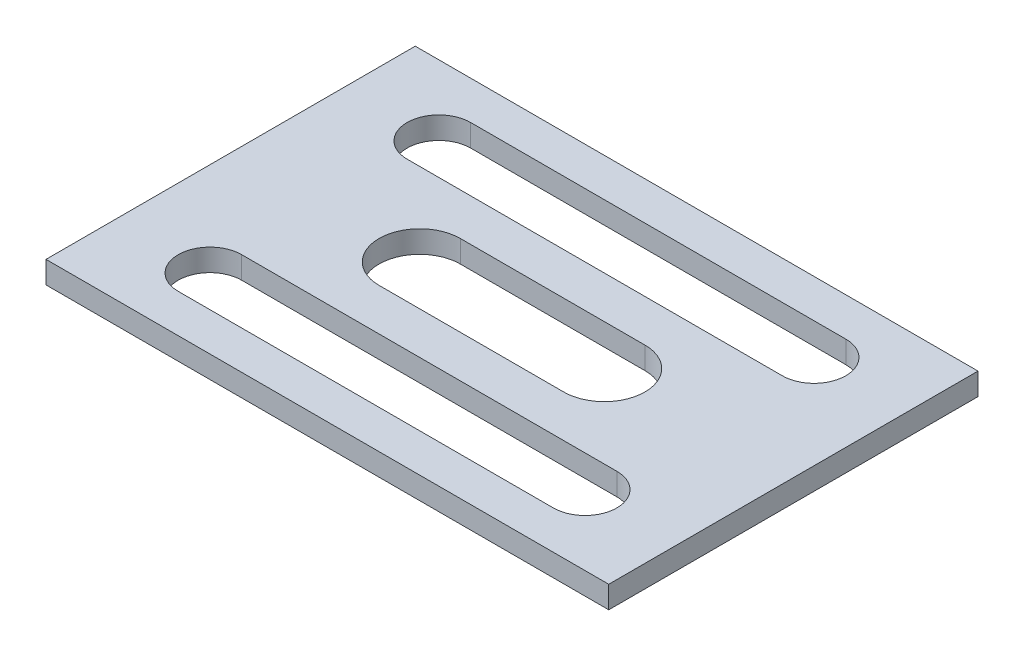
ISO-10303-21;
HEADER;
FILE_DESCRIPTION(('STEP AP214'),'2;1');
FILE_NAME('part.step','',(''),(''),'','','');
FILE_SCHEMA(('AUTOMOTIVE_DESIGN { 1 0 10303 214 1 1 1 1 }'));
ENDSEC;
DATA;
#1=APPLICATION_CONTEXT('core data for automotive mechanical design processes');
#2=APPLICATION_PROTOCOL_DEFINITION('international standard','automotive_design',2000,#1);
#3=PRODUCT_CONTEXT('',#1,'mechanical');
#4=PRODUCT('Part','Part','',(#3));
#5=PRODUCT_RELATED_PRODUCT_CATEGORY('part','',(#4));
#6=PRODUCT_DEFINITION_FORMATION('','',#4);
#7=PRODUCT_DEFINITION_CONTEXT('part definition',#1,'design');
#8=PRODUCT_DEFINITION('design','',#6,#7);
#9=PRODUCT_DEFINITION_SHAPE('','',#8);
#10=(LENGTH_UNIT() NAMED_UNIT(*) SI_UNIT(.MILLI.,.METRE.));
#11=(NAMED_UNIT(*) PLANE_ANGLE_UNIT() SI_UNIT($,.RADIAN.));
#12=(NAMED_UNIT(*) SI_UNIT($,.STERADIAN.) SOLID_ANGLE_UNIT());
#13=UNCERTAINTY_MEASURE_WITH_UNIT(LENGTH_MEASURE(1.E-05),#10,'distance_accuracy_value','');
#14=(GEOMETRIC_REPRESENTATION_CONTEXT(3) GLOBAL_UNCERTAINTY_ASSIGNED_CONTEXT((#13)) GLOBAL_UNIT_ASSIGNED_CONTEXT((#10,
#11,#12)) REPRESENTATION_CONTEXT('',''));
#15=CARTESIAN_POINT('',(0.,0.,0.));
#16=DIRECTION('',(0.,0.,1.));
#17=DIRECTION('',(1.,0.,0.));
#18=AXIS2_PLACEMENT_3D('',#15,#16,#17);
#19=CARTESIAN_POINT('',(38.1,3.,-25.));
#20=DIRECTION('',(-1.,0.,0.));
#21=DIRECTION('',(0.,0.,1.));
#22=AXIS2_PLACEMENT_3D('',#19,#20,#21);
#23=PLANE('',#22);
#24=DIRECTION('',(0.,0.,-1.));
#25=VECTOR('',#24,1.);
#26=CARTESIAN_POINT('',(38.1,0.,-25.));
#27=LINE('',#26,#25);
#28=CARTESIAN_POINT('',(38.1,0.,25.));
#29=VERTEX_POINT('',#28);
#30=CARTESIAN_POINT('',(38.1,0.,-25.));
#31=VERTEX_POINT('',#30);
#32=EDGE_CURVE('E238',#29,#31,#27,.T.);
#33=ORIENTED_EDGE('',*,*,#32,.T.);
#34=DIRECTION('',(0.,-1.,0.));
#35=VECTOR('',#34,1.);
#36=CARTESIAN_POINT('',(38.1,3.,-25.));
#37=LINE('',#36,#35);
#38=CARTESIAN_POINT('',(38.1,3.,-25.));
#39=VERTEX_POINT('',#38);
#40=EDGE_CURVE('E11',#39,#31,#37,.T.);
#41=ORIENTED_EDGE('',*,*,#40,.F.);
#42=DIRECTION('',(0.,0.,-1.));
#43=VECTOR('',#42,1.);
#44=CARTESIAN_POINT('',(38.1,3.,-25.));
#45=LINE('',#44,#43);
#46=CARTESIAN_POINT('',(38.1,3.,25.));
#47=VERTEX_POINT('',#46);
#48=EDGE_CURVE('E245',#47,#39,#45,.T.);
#49=ORIENTED_EDGE('',*,*,#48,.F.);
#50=DIRECTION('',(0.,-1.,0.));
#51=VECTOR('',#50,1.);
#52=CARTESIAN_POINT('',(38.1,3.,25.));
#53=LINE('',#52,#51);
#54=EDGE_CURVE('E255',#47,#29,#53,.T.);
#55=ORIENTED_EDGE('',*,*,#54,.T.);
#56=EDGE_LOOP('',(#33,#41,#49,#55));
#57=FACE_BOUND('',#56,.T.);
#58=ADVANCED_FACE('F32',(#57),#23,.F.);
#59=CARTESIAN_POINT('',(-38.1,3.,-25.));
#60=DIRECTION('',(0.,0.,1.));
#61=DIRECTION('',(1.,0.,0.));
#62=AXIS2_PLACEMENT_3D('',#59,#60,#61);
#63=PLANE('',#62);
#64=DIRECTION('',(-1.,0.,0.));
#65=VECTOR('',#64,1.);
#66=CARTESIAN_POINT('',(-38.1,0.,-25.));
#67=LINE('',#66,#65);
#68=CARTESIAN_POINT('',(-38.1,0.,-25.));
#69=VERTEX_POINT('',#68);
#70=EDGE_CURVE('E258',#31,#69,#67,.T.);
#71=ORIENTED_EDGE('',*,*,#70,.T.);
#72=DIRECTION('',(0.,-1.,0.));
#73=VECTOR('',#72,1.);
#74=CARTESIAN_POINT('',(-38.1,3.,-25.));
#75=LINE('',#74,#73);
#76=CARTESIAN_POINT('',(-38.1,3.,-25.));
#77=VERTEX_POINT('',#76);
#78=EDGE_CURVE('E39',#77,#69,#75,.T.);
#79=ORIENTED_EDGE('',*,*,#78,.F.);
#80=DIRECTION('',(-1.,0.,0.));
#81=VECTOR('',#80,1.);
#82=CARTESIAN_POINT('',(-38.1,3.,-25.));
#83=LINE('',#82,#81);
#84=EDGE_CURVE('E248',#39,#77,#83,.T.);
#85=ORIENTED_EDGE('',*,*,#84,.F.);
#86=ORIENTED_EDGE('',*,*,#40,.T.);
#87=EDGE_LOOP('',(#71,#79,#85,#86));
#88=FACE_BOUND('',#87,.T.);
#89=ADVANCED_FACE('F287',(#88),#63,.F.);
#90=CARTESIAN_POINT('',(-38.1,3.,-25.));
#91=DIRECTION('',(1.,0.,0.));
#92=DIRECTION('',(0.,0.,-1.));
#93=AXIS2_PLACEMENT_3D('',#90,#91,#92);
#94=PLANE('',#93);
#95=DIRECTION('',(0.,0.,1.));
#96=VECTOR('',#95,1.);
#97=CARTESIAN_POINT('',(-38.1,0.,-25.));
#98=LINE('',#97,#96);
#99=CARTESIAN_POINT('',(-38.1,0.,25.));
#100=VERTEX_POINT('',#99);
#101=EDGE_CURVE('E260',#69,#100,#98,.T.);
#102=ORIENTED_EDGE('',*,*,#101,.T.);
#103=DIRECTION('',(0.,-1.,0.));
#104=VECTOR('',#103,1.);
#105=CARTESIAN_POINT('',(-38.1,3.,25.));
#106=LINE('',#105,#104);
#107=CARTESIAN_POINT('',(-38.1,3.,25.));
#108=VERTEX_POINT('',#107);
#109=EDGE_CURVE('E265',#108,#100,#106,.T.);
#110=ORIENTED_EDGE('',*,*,#109,.F.);
#111=DIRECTION('',(0.,0.,1.));
#112=VECTOR('',#111,1.);
#113=CARTESIAN_POINT('',(-38.1,3.,-25.));
#114=LINE('',#113,#112);
#115=EDGE_CURVE('E251',#77,#108,#114,.T.);
#116=ORIENTED_EDGE('',*,*,#115,.F.);
#117=ORIENTED_EDGE('',*,*,#78,.T.);
#118=EDGE_LOOP('',(#102,#110,#116,#117));
#119=FACE_BOUND('',#118,.T.);
#120=ADVANCED_FACE('F272',(#119),#94,.F.);
#121=CARTESIAN_POINT('',(-38.1,3.,25.));
#122=DIRECTION('',(0.,0.,-1.));
#123=DIRECTION('',(-1.,0.,0.));
#124=AXIS2_PLACEMENT_3D('',#121,#122,#123);
#125=PLANE('',#124);
#126=DIRECTION('',(1.,0.,0.));
#127=VECTOR('',#126,1.);
#128=CARTESIAN_POINT('',(-38.1,0.,25.));
#129=LINE('',#128,#127);
#130=EDGE_CURVE('E249',#100,#29,#129,.T.);
#131=ORIENTED_EDGE('',*,*,#130,.T.);
#132=ORIENTED_EDGE('',*,*,#54,.F.);
#133=DIRECTION('',(1.,0.,0.));
#134=VECTOR('',#133,1.);
#135=CARTESIAN_POINT('',(-38.1,3.,25.));
#136=LINE('',#135,#134);
#137=EDGE_CURVE('E253',#108,#47,#136,.T.);
#138=ORIENTED_EDGE('',*,*,#137,.F.);
#139=ORIENTED_EDGE('',*,*,#109,.T.);
#140=EDGE_LOOP('',(#131,#132,#138,#139));
#141=FACE_BOUND('',#140,.T.);
#142=ADVANCED_FACE('F280',(#141),#125,.F.);
#143=CARTESIAN_POINT('',(0.,3.,0.));
#144=DIRECTION('',(0.,1.,0.));
#145=DIRECTION('',(0.,0.,1.));
#146=AXIS2_PLACEMENT_3D('',#143,#144,#145);
#147=PLANE('',#146);
#148=CARTESIAN_POINT('',(-12.5,3.,0.));
#149=DIRECTION('',(0.,1.,0.));
#150=DIRECTION('',(0.,0.,1.));
#151=AXIS2_PLACEMENT_3D('',#148,#149,#150);
#152=CIRCLE('',#151,5.50000000000006);
#153=CARTESIAN_POINT('',(-12.5,3.,-5.5));
#154=VERTEX_POINT('',#153);
#155=CARTESIAN_POINT('',(-12.5,3.,5.50000000000012));
#156=VERTEX_POINT('',#155);
#157=EDGE_CURVE('E46',#154,#156,#152,.T.);
#158=ORIENTED_EDGE('',*,*,#157,.F.);
#159=DIRECTION('',(-1.,0.,0.));
#160=VECTOR('',#159,1.);
#161=CARTESIAN_POINT('',(-12.5,3.,-5.5));
#162=LINE('',#161,#160);
#163=CARTESIAN_POINT('',(12.5,3.,-5.50000000000001));
#164=VERTEX_POINT('',#163);
#165=EDGE_CURVE('E162',#164,#154,#162,.T.);
#166=ORIENTED_EDGE('',*,*,#165,.F.);
#167=CARTESIAN_POINT('',(12.5,3.,0.));
#168=DIRECTION('',(0.,1.,0.));
#169=DIRECTION('',(0.,0.,1.));
#170=AXIS2_PLACEMENT_3D('',#167,#168,#169);
#171=CIRCLE('',#170,5.50000000000006);
#172=CARTESIAN_POINT('',(12.5,3.,5.50000000000006));
#173=VERTEX_POINT('',#172);
#174=EDGE_CURVE('E165',#173,#164,#171,.T.);
#175=ORIENTED_EDGE('',*,*,#174,.F.);
#176=DIRECTION('',(1.,0.,0.));
#177=VECTOR('',#176,1.);
#178=CARTESIAN_POINT('',(-12.5,3.,5.50000000000012));
#179=LINE('',#178,#177);
#180=EDGE_CURVE('E171',#156,#173,#179,.T.);
#181=ORIENTED_EDGE('',*,*,#180,.F.);
#182=EDGE_LOOP('',(#158,#166,#175,#181));
#183=FACE_BOUND('',#182,.T.);
#184=CARTESIAN_POINT('',(-25.4,3.,15.5));
#185=DIRECTION('',(0.,1.,0.));
#186=DIRECTION('',(0.,0.,-1.));
#187=AXIS2_PLACEMENT_3D('',#184,#185,#186);
#188=CIRCLE('',#187,4.3);
#189=CARTESIAN_POINT('',(-25.4,3.,11.2));
#190=VERTEX_POINT('',#189);
#191=CARTESIAN_POINT('',(-25.4,3.,19.8));
#192=VERTEX_POINT('',#191);
#193=EDGE_CURVE('E177',#190,#192,#188,.T.);
#194=ORIENTED_EDGE('',*,*,#193,.F.);
#195=DIRECTION('',(-1.,0.,0.));
#196=VECTOR('',#195,1.);
#197=CARTESIAN_POINT('',(-25.4,3.,11.2));
#198=LINE('',#197,#196);
#199=CARTESIAN_POINT('',(25.4,3.,11.2));
#200=VERTEX_POINT('',#199);
#201=EDGE_CURVE('E185',#200,#190,#198,.T.);
#202=ORIENTED_EDGE('',*,*,#201,.F.);
#203=CARTESIAN_POINT('',(25.4,3.,15.5));
#204=DIRECTION('',(0.,1.,0.));
#205=DIRECTION('',(0.,0.,-1.));
#206=AXIS2_PLACEMENT_3D('',#203,#204,#205);
#207=CIRCLE('',#206,4.3);
#208=CARTESIAN_POINT('',(25.4,3.,19.8));
#209=VERTEX_POINT('',#208);
#210=EDGE_CURVE('E199',#209,#200,#207,.T.);
#211=ORIENTED_EDGE('',*,*,#210,.F.);
#212=DIRECTION('',(1.,0.,0.));
#213=VECTOR('',#212,1.);
#214=CARTESIAN_POINT('',(-25.4,3.,19.8));
#215=LINE('',#214,#213);
#216=EDGE_CURVE('E196',#192,#209,#215,.T.);
#217=ORIENTED_EDGE('',*,*,#216,.F.);
#218=EDGE_LOOP('',(#194,#202,#211,#217));
#219=FACE_BOUND('',#218,.T.);
#220=CARTESIAN_POINT('',(-25.4,3.,-15.5));
#221=DIRECTION('',(0.,1.,0.));
#222=DIRECTION('',(0.,0.,1.));
#223=AXIS2_PLACEMENT_3D('',#220,#221,#222);
#224=CIRCLE('',#223,4.3);
#225=CARTESIAN_POINT('',(-25.4,3.,-19.8));
#226=VERTEX_POINT('',#225);
#227=CARTESIAN_POINT('',(-25.4,3.,-11.2));
#228=VERTEX_POINT('',#227);
#229=EDGE_CURVE('E206',#226,#228,#224,.T.);
#230=ORIENTED_EDGE('',*,*,#229,.F.);
#231=DIRECTION('',(-1.,0.,0.));
#232=VECTOR('',#231,1.);
#233=CARTESIAN_POINT('',(-25.4,3.,-19.8));
#234=LINE('',#233,#232);
#235=CARTESIAN_POINT('',(25.4,3.,-19.8));
#236=VERTEX_POINT('',#235);
#237=EDGE_CURVE('E217',#236,#226,#234,.T.);
#238=ORIENTED_EDGE('',*,*,#237,.F.);
#239=CARTESIAN_POINT('',(25.4,3.,-15.5));
#240=DIRECTION('',(0.,1.,0.));
#241=DIRECTION('',(0.,0.,1.));
#242=AXIS2_PLACEMENT_3D('',#239,#240,#241);
#243=CIRCLE('',#242,4.3);
#244=CARTESIAN_POINT('',(25.4,3.,-11.2));
#245=VERTEX_POINT('',#244);
#246=EDGE_CURVE('E231',#245,#236,#243,.T.);
#247=ORIENTED_EDGE('',*,*,#246,.F.);
#248=DIRECTION('',(1.,0.,0.));
#249=VECTOR('',#248,1.);
#250=CARTESIAN_POINT('',(-25.4,3.,-11.2));
#251=LINE('',#250,#249);
#252=EDGE_CURVE('E228',#228,#245,#251,.T.);
#253=ORIENTED_EDGE('',*,*,#252,.F.);
#254=EDGE_LOOP('',(#230,#238,#247,#253));
#255=FACE_BOUND('',#254,.T.);
#256=ORIENTED_EDGE('',*,*,#48,.T.);
#257=ORIENTED_EDGE('',*,*,#84,.T.);
#258=ORIENTED_EDGE('',*,*,#115,.T.);
#259=ORIENTED_EDGE('',*,*,#137,.T.);
#260=EDGE_LOOP('',(#256,#257,#258,#259));
#261=FACE_BOUND('',#260,.T.);
#262=ADVANCED_FACE('F286',(#183,#219,#255,#261),#147,.T.);
#263=CARTESIAN_POINT('',(0.,0.,0.));
#264=DIRECTION('',(0.,1.,0.));
#265=DIRECTION('',(0.,0.,1.));
#266=AXIS2_PLACEMENT_3D('',#263,#264,#265);
#267=PLANE('',#266);
#268=DIRECTION('',(-1.,0.,0.));
#269=VECTOR('',#268,1.);
#270=CARTESIAN_POINT('',(-12.5,0.,-5.5));
#271=LINE('',#270,#269);
#272=CARTESIAN_POINT('',(12.5,0.,-5.50000000000001));
#273=VERTEX_POINT('',#272);
#274=CARTESIAN_POINT('',(-12.5,0.,-5.5));
#275=VERTEX_POINT('',#274);
#276=EDGE_CURVE('E152',#273,#275,#271,.T.);
#277=ORIENTED_EDGE('',*,*,#276,.T.);
#278=CARTESIAN_POINT('',(-12.5,0.,0.));
#279=DIRECTION('',(0.,1.,0.));
#280=DIRECTION('',(0.,0.,1.));
#281=AXIS2_PLACEMENT_3D('',#278,#279,#280);
#282=CIRCLE('',#281,5.50000000000006);
#283=CARTESIAN_POINT('',(-12.5,0.,5.50000000000012));
#284=VERTEX_POINT('',#283);
#285=EDGE_CURVE('E146',#275,#284,#282,.T.);
#286=ORIENTED_EDGE('',*,*,#285,.T.);
#287=DIRECTION('',(1.,0.,0.));
#288=VECTOR('',#287,1.);
#289=CARTESIAN_POINT('',(-12.5,0.,5.50000000000012));
#290=LINE('',#289,#288);
#291=CARTESIAN_POINT('',(12.5,0.,5.50000000000012));
#292=VERTEX_POINT('',#291);
#293=EDGE_CURVE('E155',#284,#292,#290,.T.);
#294=ORIENTED_EDGE('',*,*,#293,.T.);
#295=CARTESIAN_POINT('',(12.5,0.,0.));
#296=DIRECTION('',(0.,1.,0.));
#297=DIRECTION('',(0.,0.,1.));
#298=AXIS2_PLACEMENT_3D('',#295,#296,#297);
#299=CIRCLE('',#298,5.50000000000006);
#300=EDGE_CURVE('E54',#292,#273,#299,.T.);
#301=ORIENTED_EDGE('',*,*,#300,.T.);
#302=EDGE_LOOP('',(#277,#286,#294,#301));
#303=FACE_BOUND('',#302,.T.);
#304=DIRECTION('',(-1.,0.,0.));
#305=VECTOR('',#304,1.);
#306=CARTESIAN_POINT('',(-25.4,0.,11.2));
#307=LINE('',#306,#305);
#308=CARTESIAN_POINT('',(25.4,0.,11.2));
#309=VERTEX_POINT('',#308);
#310=CARTESIAN_POINT('',(-25.4,0.,11.2));
#311=VERTEX_POINT('',#310);
#312=EDGE_CURVE('E191',#309,#311,#307,.T.);
#313=ORIENTED_EDGE('',*,*,#312,.T.);
#314=CARTESIAN_POINT('',(-25.4,0.,15.5));
#315=DIRECTION('',(0.,1.,0.));
#316=DIRECTION('',(0.,0.,-1.));
#317=AXIS2_PLACEMENT_3D('',#314,#315,#316);
#318=CIRCLE('',#317,4.3);
#319=CARTESIAN_POINT('',(-25.4,0.,19.8));
#320=VERTEX_POINT('',#319);
#321=EDGE_CURVE('E181',#311,#320,#318,.T.);
#322=ORIENTED_EDGE('',*,*,#321,.T.);
#323=DIRECTION('',(1.,0.,0.));
#324=VECTOR('',#323,1.);
#325=CARTESIAN_POINT('',(-25.4,0.,19.8));
#326=LINE('',#325,#324);
#327=CARTESIAN_POINT('',(25.4,0.,19.8));
#328=VERTEX_POINT('',#327);
#329=EDGE_CURVE('E184',#320,#328,#326,.T.);
#330=ORIENTED_EDGE('',*,*,#329,.T.);
#331=CARTESIAN_POINT('',(25.4,0.,15.5));
#332=DIRECTION('',(0.,1.,0.));
#333=DIRECTION('',(0.,0.,-1.));
#334=AXIS2_PLACEMENT_3D('',#331,#332,#333);
#335=CIRCLE('',#334,4.3);
#336=EDGE_CURVE('E188',#328,#309,#335,.T.);
#337=ORIENTED_EDGE('',*,*,#336,.T.);
#338=EDGE_LOOP('',(#313,#322,#330,#337));
#339=FACE_BOUND('',#338,.T.);
#340=DIRECTION('',(-1.,0.,0.));
#341=VECTOR('',#340,1.);
#342=CARTESIAN_POINT('',(-25.4,0.,-19.8));
#343=LINE('',#342,#341);
#344=CARTESIAN_POINT('',(25.4,0.,-19.8));
#345=VERTEX_POINT('',#344);
#346=CARTESIAN_POINT('',(-25.4,0.,-19.8));
#347=VERTEX_POINT('',#346);
#348=EDGE_CURVE('E223',#345,#347,#343,.T.);
#349=ORIENTED_EDGE('',*,*,#348,.T.);
#350=CARTESIAN_POINT('',(-25.4,0.,-15.5));
#351=DIRECTION('',(0.,1.,0.));
#352=DIRECTION('',(0.,0.,1.));
#353=AXIS2_PLACEMENT_3D('',#350,#351,#352);
#354=CIRCLE('',#353,4.3);
#355=CARTESIAN_POINT('',(-25.4,0.,-11.2));
#356=VERTEX_POINT('',#355);
#357=EDGE_CURVE('E213',#347,#356,#354,.T.);
#358=ORIENTED_EDGE('',*,*,#357,.T.);
#359=DIRECTION('',(1.,0.,0.));
#360=VECTOR('',#359,1.);
#361=CARTESIAN_POINT('',(-25.4,0.,-11.2));
#362=LINE('',#361,#360);
#363=CARTESIAN_POINT('',(25.4,0.,-11.2));
#364=VERTEX_POINT('',#363);
#365=EDGE_CURVE('E216',#356,#364,#362,.T.);
#366=ORIENTED_EDGE('',*,*,#365,.T.);
#367=CARTESIAN_POINT('',(25.4,0.,-15.5));
#368=DIRECTION('',(0.,1.,0.));
#369=DIRECTION('',(0.,0.,1.));
#370=AXIS2_PLACEMENT_3D('',#367,#368,#369);
#371=CIRCLE('',#370,4.3);
#372=EDGE_CURVE('E220',#364,#345,#371,.T.);
#373=ORIENTED_EDGE('',*,*,#372,.T.);
#374=EDGE_LOOP('',(#349,#358,#366,#373));
#375=FACE_BOUND('',#374,.T.);
#376=ORIENTED_EDGE('',*,*,#32,.F.);
#377=ORIENTED_EDGE('',*,*,#130,.F.);
#378=ORIENTED_EDGE('',*,*,#101,.F.);
#379=ORIENTED_EDGE('',*,*,#70,.F.);
#380=EDGE_LOOP('',(#376,#377,#378,#379));
#381=FACE_BOUND('',#380,.T.);
#382=ADVANCED_FACE('F159',(#303,#339,#375,#381),#267,.F.);
#383=CARTESIAN_POINT('',(-25.4,0.,-15.5));
#384=DIRECTION('',(0.,1.,0.));
#385=DIRECTION('',(0.,0.,1.));
#386=AXIS2_PLACEMENT_3D('',#383,#384,#385);
#387=CYLINDRICAL_SURFACE('',#386,4.3);
#388=ORIENTED_EDGE('',*,*,#229,.T.);
#389=DIRECTION('',(0.,1.,0.));
#390=VECTOR('',#389,1.);
#391=CARTESIAN_POINT('',(-25.4,0.,-11.2));
#392=LINE('',#391,#390);
#393=EDGE_CURVE('E226',#356,#228,#392,.T.);
#394=ORIENTED_EDGE('',*,*,#393,.F.);
#395=ORIENTED_EDGE('',*,*,#357,.F.);
#396=DIRECTION('',(0.,1.,0.));
#397=VECTOR('',#396,1.);
#398=CARTESIAN_POINT('',(-25.4,0.,-19.8));
#399=LINE('',#398,#397);
#400=EDGE_CURVE('E236',#347,#226,#399,.T.);
#401=ORIENTED_EDGE('',*,*,#400,.T.);
#402=EDGE_LOOP('',(#388,#394,#395,#401));
#403=FACE_BOUND('',#402,.T.);
#404=ADVANCED_FACE('F299',(#403),#387,.F.);
#405=CARTESIAN_POINT('',(-25.4,0.,-19.8));
#406=DIRECTION('',(0.,0.,-1.));
#407=DIRECTION('',(-1.,0.,0.));
#408=AXIS2_PLACEMENT_3D('',#405,#406,#407);
#409=PLANE('',#408);
#410=ORIENTED_EDGE('',*,*,#237,.T.);
#411=ORIENTED_EDGE('',*,*,#400,.F.);
#412=ORIENTED_EDGE('',*,*,#348,.F.);
#413=DIRECTION('',(0.,1.,0.));
#414=VECTOR('',#413,1.);
#415=CARTESIAN_POINT('',(25.4,0.,-19.8));
#416=LINE('',#415,#414);
#417=EDGE_CURVE('E239',#345,#236,#416,.T.);
#418=ORIENTED_EDGE('',*,*,#417,.T.);
#419=EDGE_LOOP('',(#410,#411,#412,#418));
#420=FACE_BOUND('',#419,.T.);
#421=ADVANCED_FACE('F305',(#420),#409,.F.);
#422=CARTESIAN_POINT('',(25.4,0.,-15.5));
#423=DIRECTION('',(0.,1.,0.));
#424=DIRECTION('',(0.,0.,1.));
#425=AXIS2_PLACEMENT_3D('',#422,#423,#424);
#426=CYLINDRICAL_SURFACE('',#425,4.3);
#427=ORIENTED_EDGE('',*,*,#246,.T.);
#428=ORIENTED_EDGE('',*,*,#417,.F.);
#429=ORIENTED_EDGE('',*,*,#372,.F.);
#430=DIRECTION('',(0.,1.,0.));
#431=VECTOR('',#430,1.);
#432=CARTESIAN_POINT('',(25.4,0.,-11.2));
#433=LINE('',#432,#431);
#434=EDGE_CURVE('E241',#364,#245,#433,.T.);
#435=ORIENTED_EDGE('',*,*,#434,.T.);
#436=EDGE_LOOP('',(#427,#428,#429,#435));
#437=FACE_BOUND('',#436,.T.);
#438=ADVANCED_FACE('F311',(#437),#426,.F.);
#439=CARTESIAN_POINT('',(-25.4,0.,-11.2));
#440=DIRECTION('',(0.,0.,1.));
#441=DIRECTION('',(1.,0.,0.));
#442=AXIS2_PLACEMENT_3D('',#439,#440,#441);
#443=PLANE('',#442);
#444=ORIENTED_EDGE('',*,*,#252,.T.);
#445=ORIENTED_EDGE('',*,*,#434,.F.);
#446=ORIENTED_EDGE('',*,*,#365,.F.);
#447=ORIENTED_EDGE('',*,*,#393,.T.);
#448=EDGE_LOOP('',(#444,#445,#446,#447));
#449=FACE_BOUND('',#448,.T.);
#450=ADVANCED_FACE('F307',(#449),#443,.F.);
#451=CARTESIAN_POINT('',(-25.4,0.,15.5));
#452=DIRECTION('',(0.,1.,0.));
#453=DIRECTION('',(0.,0.,1.));
#454=AXIS2_PLACEMENT_3D('',#451,#452,#453);
#455=CYLINDRICAL_SURFACE('',#454,4.3);
#456=ORIENTED_EDGE('',*,*,#193,.T.);
#457=DIRECTION('',(0.,1.,0.));
#458=VECTOR('',#457,1.);
#459=CARTESIAN_POINT('',(-25.4,0.,19.8));
#460=LINE('',#459,#458);
#461=EDGE_CURVE('E194',#320,#192,#460,.T.);
#462=ORIENTED_EDGE('',*,*,#461,.F.);
#463=ORIENTED_EDGE('',*,*,#321,.F.);
#464=DIRECTION('',(0.,1.,0.));
#465=VECTOR('',#464,1.);
#466=CARTESIAN_POINT('',(-25.4,0.,11.2));
#467=LINE('',#466,#465);
#468=EDGE_CURVE('E204',#311,#190,#467,.T.);
#469=ORIENTED_EDGE('',*,*,#468,.T.);
#470=EDGE_LOOP('',(#456,#462,#463,#469));
#471=FACE_BOUND('',#470,.T.);
#472=ADVANCED_FACE('F310',(#471),#455,.F.);
#473=CARTESIAN_POINT('',(-25.4,0.,11.2));
#474=DIRECTION('',(0.,0.,-1.));
#475=DIRECTION('',(-1.,0.,0.));
#476=AXIS2_PLACEMENT_3D('',#473,#474,#475);
#477=PLANE('',#476);
#478=ORIENTED_EDGE('',*,*,#201,.T.);
#479=ORIENTED_EDGE('',*,*,#468,.F.);
#480=ORIENTED_EDGE('',*,*,#312,.F.);
#481=DIRECTION('',(0.,1.,0.));
#482=VECTOR('',#481,1.);
#483=CARTESIAN_POINT('',(25.4,0.,11.2));
#484=LINE('',#483,#482);
#485=EDGE_CURVE('E207',#309,#200,#484,.T.);
#486=ORIENTED_EDGE('',*,*,#485,.T.);
#487=EDGE_LOOP('',(#478,#479,#480,#486));
#488=FACE_BOUND('',#487,.T.);
#489=ADVANCED_FACE('F321',(#488),#477,.F.);
#490=CARTESIAN_POINT('',(25.4,0.,15.5));
#491=DIRECTION('',(0.,1.,0.));
#492=DIRECTION('',(0.,0.,1.));
#493=AXIS2_PLACEMENT_3D('',#490,#491,#492);
#494=CYLINDRICAL_SURFACE('',#493,4.3);
#495=ORIENTED_EDGE('',*,*,#210,.T.);
#496=ORIENTED_EDGE('',*,*,#485,.F.);
#497=ORIENTED_EDGE('',*,*,#336,.F.);
#498=DIRECTION('',(0.,1.,0.));
#499=VECTOR('',#498,1.);
#500=CARTESIAN_POINT('',(25.4,0.,19.8));
#501=LINE('',#500,#499);
#502=EDGE_CURVE('E209',#328,#209,#501,.T.);
#503=ORIENTED_EDGE('',*,*,#502,.T.);
#504=EDGE_LOOP('',(#495,#496,#497,#503));
#505=FACE_BOUND('',#504,.T.);
#506=ADVANCED_FACE('F326',(#505),#494,.F.);
#507=CARTESIAN_POINT('',(-25.4,0.,19.8));
#508=DIRECTION('',(0.,0.,1.));
#509=DIRECTION('',(1.,0.,0.));
#510=AXIS2_PLACEMENT_3D('',#507,#508,#509);
#511=PLANE('',#510);
#512=ORIENTED_EDGE('',*,*,#216,.T.);
#513=ORIENTED_EDGE('',*,*,#502,.F.);
#514=ORIENTED_EDGE('',*,*,#329,.F.);
#515=ORIENTED_EDGE('',*,*,#461,.T.);
#516=EDGE_LOOP('',(#512,#513,#514,#515));
#517=FACE_BOUND('',#516,.T.);
#518=ADVANCED_FACE('F323',(#517),#511,.F.);
#519=CARTESIAN_POINT('',(-12.5,0.,0.));
#520=DIRECTION('',(0.,1.,0.));
#521=DIRECTION('',(0.,0.,1.));
#522=AXIS2_PLACEMENT_3D('',#519,#520,#521);
#523=CYLINDRICAL_SURFACE('',#522,5.50000000000006);
#524=ORIENTED_EDGE('',*,*,#157,.T.);
#525=DIRECTION('',(0.,1.,0.));
#526=VECTOR('',#525,1.);
#527=CARTESIAN_POINT('',(-12.5,0.,5.50000000000012));
#528=LINE('',#527,#526);
#529=EDGE_CURVE('E142',#284,#156,#528,.T.);
#530=ORIENTED_EDGE('',*,*,#529,.F.);
#531=ORIENTED_EDGE('',*,*,#285,.F.);
#532=DIRECTION('',(0.,1.,0.));
#533=VECTOR('',#532,1.);
#534=CARTESIAN_POINT('',(-12.5,0.,-5.5));
#535=LINE('',#534,#533);
#536=EDGE_CURVE('E175',#275,#154,#535,.T.);
#537=ORIENTED_EDGE('',*,*,#536,.T.);
#538=EDGE_LOOP('',(#524,#530,#531,#537));
#539=FACE_BOUND('',#538,.T.);
#540=ADVANCED_FACE('F144',(#539),#523,.F.);
#541=CARTESIAN_POINT('',(-12.5,0.,-5.5));
#542=DIRECTION('',(0.,0.,-1.));
#543=DIRECTION('',(-1.,0.,0.));
#544=AXIS2_PLACEMENT_3D('',#541,#542,#543);
#545=PLANE('',#544);
#546=ORIENTED_EDGE('',*,*,#165,.T.);
#547=ORIENTED_EDGE('',*,*,#536,.F.);
#548=ORIENTED_EDGE('',*,*,#276,.F.);
#549=DIRECTION('',(0.,1.,0.));
#550=VECTOR('',#549,1.);
#551=CARTESIAN_POINT('',(12.5,0.,-5.50000000000001));
#552=LINE('',#551,#550);
#553=EDGE_CURVE('E178',#273,#164,#552,.T.);
#554=ORIENTED_EDGE('',*,*,#553,.T.);
#555=EDGE_LOOP('',(#546,#547,#548,#554));
#556=FACE_BOUND('',#555,.T.);
#557=ADVANCED_FACE('F336',(#556),#545,.F.);
#558=CARTESIAN_POINT('',(12.5,0.,0.));
#559=DIRECTION('',(0.,1.,0.));
#560=DIRECTION('',(0.,0.,1.));
#561=AXIS2_PLACEMENT_3D('',#558,#559,#560);
#562=CYLINDRICAL_SURFACE('',#561,5.50000000000006);
#563=ORIENTED_EDGE('',*,*,#174,.T.);
#564=ORIENTED_EDGE('',*,*,#553,.F.);
#565=ORIENTED_EDGE('',*,*,#300,.F.);
#566=DIRECTION('',(0.,1.,0.));
#567=VECTOR('',#566,1.);
#568=CARTESIAN_POINT('',(12.5,0.,5.50000000000006));
#569=LINE('',#568,#567);
#570=EDGE_CURVE('E151',#292,#173,#569,.T.);
#571=ORIENTED_EDGE('',*,*,#570,.T.);
#572=EDGE_LOOP('',(#563,#564,#565,#571));
#573=FACE_BOUND('',#572,.T.);
#574=ADVANCED_FACE('F339',(#573),#562,.F.);
#575=CARTESIAN_POINT('',(-12.5,0.,5.50000000000012));
#576=DIRECTION('',(0.,0.,1.));
#577=DIRECTION('',(1.,0.,0.));
#578=AXIS2_PLACEMENT_3D('',#575,#576,#577);
#579=PLANE('',#578);
#580=ORIENTED_EDGE('',*,*,#180,.T.);
#581=ORIENTED_EDGE('',*,*,#570,.F.);
#582=ORIENTED_EDGE('',*,*,#293,.F.);
#583=ORIENTED_EDGE('',*,*,#529,.T.);
#584=EDGE_LOOP('',(#580,#581,#582,#583));
#585=FACE_BOUND('',#584,.T.);
#586=ADVANCED_FACE('F156',(#585),#579,.F.);
#587=CLOSED_SHELL('',(#58,#89,#120,#142,#262,#382,#404,#421,#438,#450,#472,#489,#506,#518,#540,
#557,#574,#586));
#588=MANIFOLD_SOLID_BREP('B2',#587);
#589=ADVANCED_BREP_SHAPE_REPRESENTATION('',(#18,#588),#14);
#590=SHAPE_DEFINITION_REPRESENTATION(#9,#589);
ENDSEC;
END-ISO-10303-21;
